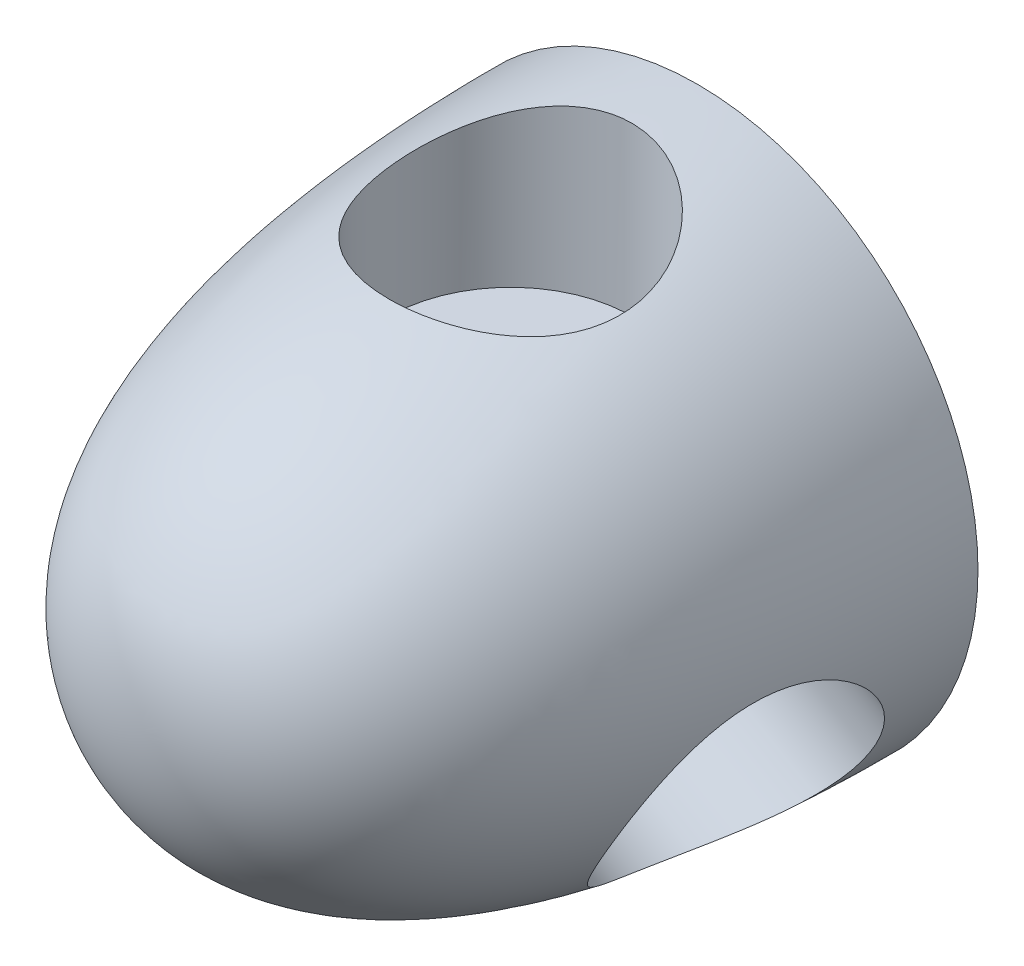
ISO-10303-21;
HEADER;
FILE_DESCRIPTION(('STEP AP214'),'2;1');
FILE_NAME('part.step','',(''),(''),'','','');
FILE_SCHEMA(('AUTOMOTIVE_DESIGN { 1 0 10303 214 1 1 1 1 }'));
ENDSEC;
DATA;
#1=APPLICATION_CONTEXT('core data for automotive mechanical design processes');
#2=APPLICATION_PROTOCOL_DEFINITION('international standard','automotive_design',2000,#1);
#3=PRODUCT_CONTEXT('',#1,'mechanical');
#4=PRODUCT('Part','Part','',(#3));
#5=PRODUCT_RELATED_PRODUCT_CATEGORY('part','',(#4));
#6=PRODUCT_DEFINITION_FORMATION('','',#4);
#7=PRODUCT_DEFINITION_CONTEXT('part definition',#1,'design');
#8=PRODUCT_DEFINITION('design','',#6,#7);
#9=PRODUCT_DEFINITION_SHAPE('','',#8);
#10=(LENGTH_UNIT() NAMED_UNIT(*) SI_UNIT(.MILLI.,.METRE.));
#11=(NAMED_UNIT(*) PLANE_ANGLE_UNIT() SI_UNIT($,.RADIAN.));
#12=(NAMED_UNIT(*) SI_UNIT($,.STERADIAN.) SOLID_ANGLE_UNIT());
#13=UNCERTAINTY_MEASURE_WITH_UNIT(LENGTH_MEASURE(1.E-05),#10,'distance_accuracy_value','');
#14=(GEOMETRIC_REPRESENTATION_CONTEXT(3) GLOBAL_UNCERTAINTY_ASSIGNED_CONTEXT((#13)) GLOBAL_UNIT_ASSIGNED_CONTEXT((#10,
#11,#12)) REPRESENTATION_CONTEXT('',''));
#15=CARTESIAN_POINT('',(0.,0.,0.));
#16=DIRECTION('',(0.,0.,1.));
#17=DIRECTION('',(1.,0.,0.));
#18=AXIS2_PLACEMENT_3D('',#15,#16,#17);
#19=CARTESIAN_POINT('',(0.,19.05,-38.1));
#20=CARTESIAN_POINT('',(0.,19.05,-23.9009683428763));
#21=CARTESIAN_POINT('',(0.,16.9337441759972,0.));
#22=CARTESIAN_POINT('',(0.,0.,0.));
#23=B_SPLINE_CURVE_WITH_KNOTS('',3,(#19,#20,#21,#22),.UNSPECIFIED.,.F.,.F.,(4,4),(0.,1.),.UNSPECIFIED.);
#24=CARTESIAN_POINT('',(0.,0.,26.4035099652344));
#25=DIRECTION('',(0.,0.,1.));
#26=AXIS1_PLACEMENT('',#24,#25);
#27=SURFACE_OF_REVOLUTION('',#23,#26);
#28=CARTESIAN_POINT('',(-18.338251247711,-1.05554135001232,-25.4));
#29=CARTESIAN_POINT('',(-18.3132255403974,-1.04109096691939,-25.1821406028059));
#30=CARTESIAN_POINT('',(-18.2867299690812,-1.03576026781716,-24.9638653361562));
#31=CARTESIAN_POINT('',(-18.2309375606609,-1.04355308694575,-24.5280100617168));
#32=CARTESIAN_POINT('',(-18.2016410185457,-1.05667466383545,-24.3104299832009));
#33=CARTESIAN_POINT('',(-18.140302448093,-1.10133095664503,-23.8776443267072));
#34=CARTESIAN_POINT('',(-18.108261445462,-1.13285881885448,-23.6624378952598));
#35=CARTESIAN_POINT('',(-18.0413656867623,-1.21402161156929,-23.2359047372756));
#36=CARTESIAN_POINT('',(-18.0065108273885,-1.26365720709886,-23.0245781535295));
#37=CARTESIAN_POINT('',(-17.9338631580454,-1.38043747094698,-22.60751792359));
#38=CARTESIAN_POINT('',(-17.8960725691054,-1.44756899153432,-22.4017802051635));
#39=CARTESIAN_POINT('',(-17.8172953477507,-1.59858583342111,-21.997188378116));
#40=CARTESIAN_POINT('',(-17.7763087318569,-1.68247106812015,-21.7983342339199));
#41=CARTESIAN_POINT('',(-17.6908332787788,-1.86605842307884,-21.4088284086526));
#42=CARTESIAN_POINT('',(-17.6463440396681,-1.96576235987224,-21.2181776728165));
#43=CARTESIAN_POINT('',(-17.5535051396194,-2.17993959255016,-20.8462600472301));
#44=CARTESIAN_POINT('',(-17.505154087247,-2.29441822107739,-20.6649965788978));
#45=CARTESIAN_POINT('',(-17.403279734969,-2.53924794898595,-20.3096994053259));
#46=CARTESIAN_POINT('',(-17.3496757808335,-2.66985873291386,-20.135867809447));
#47=CARTESIAN_POINT('',(-17.2377009813602,-2.94387505254788,-19.8002389983359));
#48=CARTESIAN_POINT('',(-17.1793299862201,-3.08728099034971,-19.6384421615966));
#49=CARTESIAN_POINT('',(-17.0574399520563,-3.38558754302899,-19.3278153421201));
#50=CARTESIAN_POINT('',(-16.9939194159118,-3.54049149960127,-19.1789891566111));
#51=CARTESIAN_POINT('',(-16.8614504652655,-3.86033404969433,-18.8952990762229));
#52=CARTESIAN_POINT('',(-16.7925037375717,-4.02526952118368,-18.7604308722542));
#53=CARTESIAN_POINT('',(-16.6458383559802,-4.37108792275384,-18.4999633434661));
#54=CARTESIAN_POINT('',(-16.5678704238896,-4.55235135704167,-18.375008794062));
#55=CARTESIAN_POINT('',(-16.4055666022298,-4.92272348937912,-18.1419909713554));
#56=CARTESIAN_POINT('',(-16.3212305303333,-5.11183241198443,-18.0339281819561));
#57=CARTESIAN_POINT('',(-16.1461482898674,-5.49625501558963,-17.8354830396041));
#58=CARTESIAN_POINT('',(-16.0554023056279,-5.69156851807561,-17.7451001785111));
#59=CARTESIAN_POINT('',(-15.8676020458417,-6.08674673287268,-17.582702741381));
#60=CARTESIAN_POINT('',(-15.7705478732272,-6.28661137088732,-17.5106878657237));
#61=CARTESIAN_POINT('',(-15.5708766704435,-6.68825702474376,-17.3859022822127));
#62=CARTESIAN_POINT('',(-15.4682886242767,-6.89002420982705,-17.3330407297363));
#63=CARTESIAN_POINT('',(-15.2575553109791,-7.2947733807142,-17.2465162404061));
#64=CARTESIAN_POINT('',(-15.1494100440715,-7.49775536646929,-17.2128533027816));
#65=CARTESIAN_POINT('',(-14.9281759847379,-7.90328784749894,-17.1650163720421));
#66=CARTESIAN_POINT('',(-14.8150878459817,-8.10583839613573,-17.1508398099502));
#67=CARTESIAN_POINT('',(-14.5847176838103,-8.50896590268909,-17.1420907476886));
#68=CARTESIAN_POINT('',(-14.4674357335467,-8.70954289495214,-17.1475179057413));
#69=CARTESIAN_POINT('',(-14.2324029649059,-9.10253618175611,-17.1775678914416));
#70=CARTESIAN_POINT('',(-14.1147286561624,-9.29503332856662,-17.2017342803041));
#71=CARTESIAN_POINT('',(-13.8772282572263,-9.67544122002487,-17.2685097482364));
#72=CARTESIAN_POINT('',(-13.7574022037144,-9.86335204272691,-17.3111185132053));
#73=CARTESIAN_POINT('',(-13.5166730001384,-10.2334217278372,-17.414438765366));
#74=CARTESIAN_POINT('',(-13.3957698223591,-10.4155804416882,-17.4751507196792));
#75=CARTESIAN_POINT('',(-13.1540535202759,-10.7730987414592,-17.6142081780558));
#76=CARTESIAN_POINT('',(-13.0332403971189,-10.9484582422,-17.6925539029479));
#77=CARTESIAN_POINT('',(-12.7922808190888,-11.2924059180293,-17.8667764610262));
#78=CARTESIAN_POINT('',(-12.6721416646983,-11.4609516368785,-17.9627471715727));
#79=CARTESIAN_POINT('',(-12.434473006335,-11.7895097640714,-18.1712853298208));
#80=CARTESIAN_POINT('',(-12.3169444914932,-11.9495189691954,-18.2838589487326));
#81=CARTESIAN_POINT('',(-12.0859256940513,-12.2602297898822,-18.5247869658668));
#82=CARTESIAN_POINT('',(-11.9724345591941,-12.4109333747851,-18.6531380078129));
#83=CARTESIAN_POINT('',(-11.7508047280878,-12.7025699444456,-18.9248667835384));
#84=CARTESIAN_POINT('',(-11.642668542657,-12.8434983580193,-19.0682514698604));
#85=CARTESIAN_POINT('',(-11.4306244806416,-13.118395812347,-19.3728234252303));
#86=CARTESIAN_POINT('',(-11.3268876752748,-13.2521060187795,-19.5343636775904));
#87=CARTESIAN_POINT('',(-11.1281621066984,-13.5081849435874,-19.8710873932665));
#88=CARTESIAN_POINT('',(-11.0331693722447,-13.630558810685,-20.0462645957797));
#89=CARTESIAN_POINT('',(-10.853363414889,-13.8637013955616,-20.4092423262025));
#90=CARTESIAN_POINT('',(-10.7685542119203,-13.9744655282371,-20.5970477937628));
#91=CARTESIAN_POINT('',(-10.6106708848611,-14.1839517587486,-20.9838589055913));
#92=CARTESIAN_POINT('',(-10.5375917328054,-14.2826790116823,-21.1828597014331));
#93=CARTESIAN_POINT('',(-10.4051895266833,-14.4668986141064,-21.5886313892175));
#94=CARTESIAN_POINT('',(-10.3457335977602,-14.5525158397158,-21.795302162164));
#95=CARTESIAN_POINT('',(-10.2408295161392,-14.7114510690772,-22.2167763423075));
#96=CARTESIAN_POINT('',(-10.1953812798268,-14.7847691462439,-22.4315797009509));
#97=CARTESIAN_POINT('',(-10.1194966063699,-14.9188555519086,-22.8675691249547));
#98=CARTESIAN_POINT('',(-10.0890543540897,-14.9796287365023,-23.0887526826247));
#99=CARTESIAN_POINT('',(-10.0438747013651,-15.0884792395382,-23.5357952769567));
#100=CARTESIAN_POINT('',(-10.0291366454713,-15.1365570877855,-23.7616541180842));
#101=CARTESIAN_POINT('',(-10.0160789900574,-15.2178990956982,-24.2053235454945));
#102=CARTESIAN_POINT('',(-10.0170085127918,-15.2517613290419,-24.4230030128992));
#103=CARTESIAN_POINT('',(-10.0335142173786,-15.3077990019089,-24.8593005858151));
#104=CARTESIAN_POINT('',(-10.0490898878476,-15.3299748494305,-25.0779186582888));
#105=CARTESIAN_POINT('',(-10.0946599597297,-15.3626239120516,-25.5145262841532));
#106=CARTESIAN_POINT('',(-10.1246549219723,-15.3730966719142,-25.7325158127653));
#107=CARTESIAN_POINT('',(-10.198579043572,-15.3823595772055,-26.1663656902783));
#108=CARTESIAN_POINT('',(-10.2425084691572,-15.3811494994124,-26.3822259984177));
#109=CARTESIAN_POINT('',(-10.3436272635097,-15.367091375947,-26.8105416520689));
#110=CARTESIAN_POINT('',(-10.4008235087006,-15.3542372849071,-27.0229951705179));
#111=CARTESIAN_POINT('',(-10.5276184628152,-15.3169400725797,-27.443202719806));
#112=CARTESIAN_POINT('',(-10.5972215840199,-15.2924928232427,-27.6509550490331));
#113=CARTESIAN_POINT('',(-10.7478255590731,-15.2320768322234,-28.0605389746509));
#114=CARTESIAN_POINT('',(-10.8288253939105,-15.1961091202503,-28.2623710984354));
#115=CARTESIAN_POINT('',(-11.0011987965259,-15.1126978599323,-28.6591929761292));
#116=CARTESIAN_POINT('',(-11.0925761081734,-15.0652501629441,-28.8541802271985));
#117=CARTESIAN_POINT('',(-11.2916238394784,-14.9550347119322,-29.250333133288));
#118=CARTESIAN_POINT('',(-11.399997505221,-14.891399155422,-29.4509046266284));
#119=CARTESIAN_POINT('',(-11.6260240963162,-14.7510141064939,-29.8419802794998));
#120=CARTESIAN_POINT('',(-11.7436774783267,-14.674263968486,-30.0324839428181));
#121=CARTESIAN_POINT('',(-11.9869387745243,-14.5076406592613,-30.4025279167878));
#122=CARTESIAN_POINT('',(-12.1125512073891,-14.4177599948128,-30.5820618838056));
#123=CARTESIAN_POINT('',(-12.3702236867393,-14.2249894909913,-30.9290061262909));
#124=CARTESIAN_POINT('',(-12.5022816125515,-14.1221039129714,-31.0964203449339));
#125=CARTESIAN_POINT('',(-12.7789044997521,-13.8973402633902,-31.4270869545246));
#126=CARTESIAN_POINT('',(-12.9237575687022,-13.7747276909319,-31.5896006452737));
#127=CARTESIAN_POINT('',(-13.2173734400895,-13.5153008467625,-31.8988567869055));
#128=CARTESIAN_POINT('',(-13.366134672818,-13.378492213671,-32.0456054528126));
#129=CARTESIAN_POINT('',(-13.6659108434467,-13.0909228638953,-32.3222013702942));
#130=CARTESIAN_POINT('',(-13.8169258765712,-12.9401615562944,-32.4520479054773));
#131=CARTESIAN_POINT('',(-14.119431467998,-12.6251768527726,-32.6936007704942));
#132=CARTESIAN_POINT('',(-14.2709219942882,-12.4609543451794,-32.8053082959043));
#133=CARTESIAN_POINT('',(-14.5662212964586,-12.12695222889,-33.0050916253901));
#134=CARTESIAN_POINT('',(-14.710084813079,-11.9576982455964,-33.0939647748456));
#135=CARTESIAN_POINT('',(-14.9950022542441,-11.6083602329288,-33.2529981143827));
#136=CARTESIAN_POINT('',(-15.1360562318833,-11.4282764084749,-33.3231586584041));
#137=CARTESIAN_POINT('',(-15.413690746163,-11.0585242439642,-33.4438778740174));
#138=CARTESIAN_POINT('',(-15.5502739483341,-10.8688617928977,-33.4944484277262));
#139=CARTESIAN_POINT('',(-15.8175417927325,-10.4812537629843,-33.5753823133225));
#140=CARTESIAN_POINT('',(-15.9482269358228,-10.2833088902417,-33.6057473640819));
#141=CARTESIAN_POINT('',(-16.1910107703723,-9.89869123621395,-33.644075097458));
#142=CARTESIAN_POINT('',(-16.303728790355,-9.71258166512639,-33.6537900081367));
#143=CARTESIAN_POINT('',(-16.5222094375326,-9.33623334214296,-33.6559973760945));
#144=CARTESIAN_POINT('',(-16.6279725333561,-9.14599486960714,-33.6484909949843));
#145=CARTESIAN_POINT('',(-16.8317725119916,-8.7628853281786,-33.6163473351253));
#146=CARTESIAN_POINT('',(-16.9298104635329,-8.57001462778604,-33.591712430658));
#147=CARTESIAN_POINT('',(-17.1175968230774,-8.1831318130283,-33.525597618459));
#148=CARTESIAN_POINT('',(-17.2073451985096,-7.9891196941815,-33.4841176445441));
#149=CARTESIAN_POINT('',(-17.3755949248991,-7.60729269093802,-33.3862616411581));
#150=CARTESIAN_POINT('',(-17.4543527467473,-7.41946634620873,-33.3303693323782));
#151=CARTESIAN_POINT('',(-17.6035303216947,-7.0454578316082,-33.2036892311547));
#152=CARTESIAN_POINT('',(-17.67394714268,-6.85927626108319,-33.1328962248072));
#153=CARTESIAN_POINT('',(-17.8063525990815,-6.48995937656537,-32.9770826513727));
#154=CARTESIAN_POINT('',(-17.8683431351993,-6.30682338379442,-32.8920653025291));
#155=CARTESIAN_POINT('',(-17.9840284892817,-5.94470203932761,-32.7084569959109));
#156=CARTESIAN_POINT('',(-18.0377200848956,-5.76571832270756,-32.6098607936357));
#157=CARTESIAN_POINT('',(-18.1397997827937,-5.40310154398693,-32.3938886413729));
#158=CARTESIAN_POINT('',(-18.1877143065342,-5.2197806312428,-32.2757646836768));
#159=CARTESIAN_POINT('',(-18.2748412503756,-4.86029741724425,-32.0260236793815));
#160=CARTESIAN_POINT('',(-18.3140498179325,-4.68413831327618,-31.8944006967319));
#161=CARTESIAN_POINT('',(-18.3841755593521,-4.34021360387896,-31.6185560691322));
#162=CARTESIAN_POINT('',(-18.4150919297089,-4.17244881313099,-31.4743332050596));
#163=CARTESIAN_POINT('',(-18.4691211824069,-3.84643391614052,-31.1741449563633));
#164=CARTESIAN_POINT('',(-18.4922336132875,-3.68818436079269,-31.0181788930299));
#165=CARTESIAN_POINT('',(-18.532866580796,-3.36904630118806,-30.6813797885465));
#166=CARTESIAN_POINT('',(-18.5497313914245,-3.20911125485965,-30.4995625324565));
#167=CARTESIAN_POINT('',(-18.5755755133269,-2.90312546986241,-30.1241712961085));
#168=CARTESIAN_POINT('',(-18.5845572478294,-2.75707047683538,-29.9306009482839));
#169=CARTESIAN_POINT('',(-18.595365254265,-2.47996020666205,-29.532507812999));
#170=CARTESIAN_POINT('',(-18.59718407533,-2.34892068606812,-29.327973845143));
#171=CARTESIAN_POINT('',(-18.5943536894087,-2.10338741179392,-28.9093488384581));
#172=CARTESIAN_POINT('',(-18.5897068764267,-1.98888755136449,-28.6952613653721));
#173=CARTESIAN_POINT('',(-18.5738368770974,-1.76657458735284,-28.2357079931419));
#174=CARTESIAN_POINT('',(-18.5619741334192,-1.6607274319222,-27.9893083270157));
#175=CARTESIAN_POINT('',(-18.5320393331828,-1.47245653954558,-27.4880342341809));
#176=CARTESIAN_POINT('',(-18.513966567314,-1.39003548030094,-27.2331588423776));
#177=CARTESIAN_POINT('',(-18.4723882703837,-1.25024577240042,-26.7172932601795));
#178=CARTESIAN_POINT('',(-18.4488877417371,-1.19285419551789,-26.4563088978463));
#179=CARTESIAN_POINT('',(-18.3970688998614,-1.10431092680795,-25.9304216346254));
#180=CARTESIAN_POINT('',(-18.3687517353027,-1.07315298930375,-25.6655196817244));
#181=CARTESIAN_POINT('',(-18.338251247711,-1.05554135001232,-25.4));
#182=B_SPLINE_CURVE_WITH_KNOTS('',3,(#28,#29,#30,#31,#32,#33,#34,#35,#36,#37,#38,#39,#40,#41,
#42,#43,#44,#45,#46,#47,#48,#49,#50,#51,#52,#53,#54,#55,#56,#57,#58,#59,#60,#61,#62,#63,#64,#65,
#66,#67,#68,#69,#70,#71,#72,#73,#74,#75,#76,#77,#78,#79,#80,#81,#82,#83,#84,#85,#86,#87,#88,#89,
#90,#91,#92,#93,#94,#95,#96,#97,#98,#99,#100,#101,#102,#103,#104,#105,#106,#107,#108,#109,#110,
#111,#112,#113,#114,#115,#116,#117,#118,#119,#120,#121,#122,#123,#124,#125,#126,#127,#128,#129,
#130,#131,#132,#133,#134,#135,#136,#137,#138,#139,#140,#141,#142,#143,#144,#145,#146,#147,#148,
#149,#150,#151,#152,#153,#154,#155,#156,#157,#158,#159,#160,#161,#162,#163,#164,#165,#166,#167,
#168,#169,#170,#171,#172,#173,#174,#175,#176,#177,#178,#179,#180,#181),.UNSPECIFIED.,.T.,.F.,(4,
2,2,2,2,2,2,2,2,2,2,2,2,2,2,2,2,2,2,2,2,2,2,2,2,2,2,2,2,2,2,2,2,2,2,2,2,2,2,2,2,2,2,2,2,2,2,2,2,
2,2,2,2,2,2,2,2,2,2,2,2,2,2,2,2,2,2,2,2,2,2,2,2,2,2,2,4),(0.,0.659069173698017,1.31806901273081,
1.97682362488091,2.6356024328738,3.29388760610296,3.9521693767259,4.61052679563518,
5.26912250410829,5.94019921713904,6.61129702660875,7.28259064822643,7.95367640686057,
8.65351720425097,9.35337804651306,10.0532187710644,10.753048079022,11.4495132330367,
12.1459783590907,12.8423516581889,13.5387128165483,14.2186255937823,14.8985267915534,
15.5784455345134,16.2583727926089,16.9420325627508,17.6259470889153,18.3097163792775,
18.9938032959514,19.694834241764,20.3955452171106,21.0965318939878,21.7972172931072,
22.490746227949,23.1842710229108,23.8775268506704,24.5707537427264,25.2308559526864,
25.8909351154443,26.5510399536487,27.2111574043918,27.8716177731066,28.5323134929311,
29.1929501756587,29.8538259571559,30.5631260448625,31.2724610592674,31.9822024645706,
32.6917119070597,33.4403502085802,34.188692283937,34.9370660672122,35.6853905037202,
36.4021872544648,37.1189704463887,37.8353181972033,38.5516050008866,39.2041869913654,
39.8567249651737,40.5091725050342,41.1616226083514,41.7945177102103,42.427634637678,
43.060608516288,43.6938275548052,44.3629644462726,45.0323968554661,45.7018941086009,
46.3714300857428,47.098817670626,47.8259815808482,48.5539016880701,49.2815523429456,
50.0856412990738,50.8898221290235,51.6932647347959,52.4965160036806),.UNSPECIFIED.);
#183=CARTESIAN_POINT('',(-18.338251247711,-1.05554135001232,-25.4));
#184=VERTEX_POINT('',#183);
#185=EDGE_CURVE('E56',#184,#184,#182,.T.);
#186=ORIENTED_EDGE('',*,*,#185,.T.);
#187=EDGE_LOOP('',(#186));
#188=FACE_BOUND('',#187,.T.);
#189=CARTESIAN_POINT('',(0.,0.,-38.1));
#190=DIRECTION('',(0.,0.,1.));
#191=DIRECTION('',(1.,0.,0.));
#192=AXIS2_PLACEMENT_3D('',#189,#190,#191);
#193=CIRCLE('',#192,19.05);
#194=CARTESIAN_POINT('',(19.05,0.,-38.1));
#195=VERTEX_POINT('',#194);
#196=EDGE_CURVE('E11',#195,#195,#193,.T.);
#197=ORIENTED_EDGE('',*,*,#196,.T.);
#198=EDGE_LOOP('',(#197));
#199=FACE_BOUND('',#198,.T.);
#200=CARTESIAN_POINT('',(0.,0.,0.));
#201=VERTEX_POINT('',#200);
#202=VERTEX_LOOP('',#201);
#203=FACE_BOUND('',#202,.T.);
#204=CARTESIAN_POINT('',(0.,18.9763018383334,-33.655));
#205=CARTESIAN_POINT('',(0.218211078954212,18.9763022513523,-33.6550005686562));
#206=CARTESIAN_POINT('',(0.43641442111094,18.9722345507482,-33.6463396951044));
#207=CARTESIAN_POINT('',(0.871144042653201,18.9560573129827,-33.6118008701064));
#208=CARTESIAN_POINT('',(1.08767040292133,18.9439481661432,-33.5859237543153));
#209=CARTESIAN_POINT('',(1.51743998162799,18.9119582977859,-33.5172507796383));
#210=CARTESIAN_POINT('',(1.73068310557535,18.8920773530295,-33.474454434761));
#211=CARTESIAN_POINT('',(2.15236542127592,18.8449772614248,-33.372415482399));
#212=CARTESIAN_POINT('',(2.36080452305338,18.8177579772558,-33.3131725671529));
#213=CARTESIAN_POINT('',(2.7708903116773,18.7566429551785,-33.1790487065769));
#214=CARTESIAN_POINT('',(2.97255493238313,18.7227667942276,-33.1042135777946));
#215=CARTESIAN_POINT('',(3.36856493301669,18.6489552318792,-32.9394834431129));
#216=CARTESIAN_POINT('',(3.56290753940635,18.6090175626559,-32.849582799352));
#217=CARTESIAN_POINT('',(3.94308256356838,18.5238613882089,-32.6555255845017));
#218=CARTESIAN_POINT('',(4.12891673854074,18.4786439802919,-32.5513719748853));
#219=CARTESIAN_POINT('',(4.49120576491486,18.3837451781798,-32.3295934773028));
#220=CARTESIAN_POINT('',(4.66765691282269,18.3340620418671,-32.21196332707));
#221=CARTESIAN_POINT('',(5.19895753091008,18.1743938736086,-31.8275222312541));
#222=CARTESIAN_POINT('',(5.53653946005925,18.0581933062236,-31.5389447915065));
#223=CARTESIAN_POINT('',(6.16002799663892,17.8182337172331,-30.9131112452231));
#224=CARTESIAN_POINT('',(6.44591148077657,17.6944713463876,-30.5758334770679));
#225=CARTESIAN_POINT('',(6.84188005031169,17.5048624089158,-30.024967637072));
#226=CARTESIAN_POINT('',(6.97232701290917,17.4385706693425,-29.825876894076));
#227=CARTESIAN_POINT('',(7.21574423415548,17.3076613694495,-29.4167965166386));
#228=CARTESIAN_POINT('',(7.32872054004017,17.2430432363096,-29.2068106871496));
#229=CARTESIAN_POINT('',(7.5364327117597,17.1167773433105,-28.7770127256739));
#230=CARTESIAN_POINT('',(7.63115937505361,17.0551310937352,-28.5571957047011));
#231=CARTESIAN_POINT('',(7.80144100117607,16.9361654206379,-28.1092295823325));
#232=CARTESIAN_POINT('',(7.87700461082378,16.8788440538589,-27.8810842921986));
#233=CARTESIAN_POINT('',(8.00789634162893,16.7699796676346,-27.4189182659425));
#234=CARTESIAN_POINT('',(8.06331745887122,16.7184108746828,-27.1849300029271));
#235=CARTESIAN_POINT('',(8.15368195587697,16.6218330055621,-26.7116858889895));
#236=CARTESIAN_POINT('',(8.18862522858259,16.5768239636885,-26.4724300105351));
#237=CARTESIAN_POINT('',(8.23739996769746,16.4943015195881,-25.9906383213747));
#238=CARTESIAN_POINT('',(8.25124438777342,16.4567835305268,-25.7481046154564));
#239=CARTESIAN_POINT('',(8.25742313991828,16.3898765340559,-25.2616487222552));
#240=CARTESIAN_POINT('',(8.2497593006894,16.360486835786,-25.0177266547752));
#241=CARTESIAN_POINT('',(8.21419554900191,16.3121849419798,-24.5499333079105));
#242=CARTESIAN_POINT('',(8.1879438602203,16.2926279706806,-24.3260018388071));
#243=CARTESIAN_POINT('',(8.11708934597051,16.2607395680525,-23.8805463791341));
#244=CARTESIAN_POINT('',(8.07248752975279,16.2484077394339,-23.6590222568489));
#245=CARTESIAN_POINT('',(7.96519068206704,16.2307519281812,-23.2201388566519));
#246=CARTESIAN_POINT('',(7.90249711257766,16.2254273794884,-23.0027792437227));
#247=CARTESIAN_POINT('',(7.75945953938698,16.2213314487669,-22.5738871624903));
#248=CARTESIAN_POINT('',(7.67911557113858,16.2225600535756,-22.3623546824836));
#249=CARTESIAN_POINT('',(7.50457508652718,16.2307647735812,-21.9541506548146));
#250=CARTESIAN_POINT('',(7.41097763621885,16.2375335018484,-21.7572181967883));
#251=CARTESIAN_POINT('',(7.20857080118281,16.2558279815828,-21.3714779053902));
#252=CARTESIAN_POINT('',(7.09975599507693,16.267355431275,-21.1826729990526));
#253=CARTESIAN_POINT('',(6.86772081906003,16.2943371027011,-20.8145040759658));
#254=CARTESIAN_POINT('',(6.74450417171299,16.3097903109181,-20.6351376368841));
#255=CARTESIAN_POINT('',(6.48439893158072,16.3437457334768,-20.2867946018461));
#256=CARTESIAN_POINT('',(6.34750410444134,16.3622493406748,-20.1178228008558));
#257=CARTESIAN_POINT('',(6.0552020567276,16.4021716796698,-19.7847896422554));
#258=CARTESIAN_POINT('',(5.89927264206554,16.4236775492973,-19.6211968413961));
#259=CARTESIAN_POINT('',(5.57469612528407,16.4679575197658,-19.3074872782167));
#260=CARTESIAN_POINT('',(5.40605414672928,16.4907311087182,-19.1573651396636));
#261=CARTESIAN_POINT('',(5.05697074579832,16.5365717949921,-18.8713698442033));
#262=CARTESIAN_POINT('',(4.87652284035333,16.55963904788,-18.7355046247445));
#263=CARTESIAN_POINT('',(4.5051133162269,16.6051017750843,-18.4790250841266));
#264=CARTESIAN_POINT('',(4.31415547360709,16.6274974862654,-18.3584053361852));
#265=CARTESIAN_POINT('',(3.9164581271744,16.6714619631989,-18.1294615584017));
#266=CARTESIAN_POINT('',(3.70940669789721,16.6929797023879,-18.0216689101614));
#267=CARTESIAN_POINT('',(3.28671169170763,16.7335167325747,-17.8239194505039));
#268=CARTESIAN_POINT('',(3.07106790985398,16.7525359639327,-17.7339630648161));
#269=CARTESIAN_POINT('',(2.63271795327242,16.7873321839229,-17.5725890675039));
#270=CARTESIAN_POINT('',(2.41001247748036,16.8031094922775,-17.5011696275603));
#271=CARTESIAN_POINT('',(1.95912240708195,16.8308187150126,-17.3774372059911));
#272=CARTESIAN_POINT('',(1.73093793619869,16.8427507161377,-17.3251237933572));
#273=CARTESIAN_POINT('',(1.27429743598264,16.862167114619,-17.2406939611263));
#274=CARTESIAN_POINT('',(1.04589910122419,16.8697168369112,-17.2082804558152));
#275=CARTESIAN_POINT('',(0.587087582102023,16.8803732168368,-17.1626765260383));
#276=CARTESIAN_POINT('',(0.356674413941267,16.8834799101674,-17.1494859471277));
#277=CARTESIAN_POINT('',(-0.104440347798179,16.8851367227885,-17.1424409376878));
#278=CARTESIAN_POINT('',(-0.335141910254467,16.8836872973746,-17.1485845750784));
#279=CARTESIAN_POINT('',(-0.79514739990477,16.8762856898303,-17.1801511724314));
#280=CARTESIAN_POINT('',(-1.02445134068592,16.8703335515439,-17.2055739446671));
#281=CARTESIAN_POINT('',(-1.47566642527759,16.8542978216727,-17.2748203605647));
#282=CARTESIAN_POINT('',(-1.69763536511261,16.844294502676,-17.3182868711237));
#283=CARTESIAN_POINT('',(-2.13706508685162,16.8205177309705,-17.4232209068863));
#284=CARTESIAN_POINT('',(-2.35452593461617,16.8067443333823,-17.4846881689108));
#285=CARTESIAN_POINT('',(-2.78348371165801,16.7759166603932,-17.6251570557117));
#286=CARTESIAN_POINT('',(-2.99498019563222,16.7588621407614,-17.7041599858262));
#287=CARTESIAN_POINT('',(-3.41060085409939,16.7220882441522,-17.8791179159225));
#288=CARTESIAN_POINT('',(-3.61472489898093,16.7023688203534,-17.9750732137614));
#289=CARTESIAN_POINT('',(-4.0171368100468,16.6606963729058,-18.1847492884799));
#290=CARTESIAN_POINT('',(-4.21529999495601,16.6387155152994,-18.2987038233564));
#291=CARTESIAN_POINT('',(-4.60147289753045,16.59361052211,-18.5426208895755));
#292=CARTESIAN_POINT('',(-4.7894790688391,16.5704859925392,-18.6725889607997));
#293=CARTESIAN_POINT('',(-5.15406499324501,16.5240435684958,-18.9476526390837));
#294=CARTESIAN_POINT('',(-5.33064431004403,16.5007256666783,-19.092748823211));
#295=CARTESIAN_POINT('',(-5.67122668747625,16.4549068223632,-19.3971360451616));
#296=CARTESIAN_POINT('',(-5.83522975621658,16.432405879339,-19.5564270738342));
#297=CARTESIAN_POINT('',(-6.15289390050983,16.3888182793481,-19.8917002050576));
#298=CARTESIAN_POINT('',(-6.30626402781221,16.3677714426269,-20.0679634074595));
#299=CARTESIAN_POINT('',(-6.59761037834033,16.3287725442074,-20.4330014280904));
#300=CARTESIAN_POINT('',(-6.735592294141,16.3108193367313,-20.621771578142));
#301=CARTESIAN_POINT('',(-6.99519281227402,16.2791161063752,-21.0105874842184));
#302=CARTESIAN_POINT('',(-7.11681152305516,16.2653660556375,-21.210633165501));
#303=CARTESIAN_POINT('',(-7.34272545937974,16.2431229530751,-21.6205595050431));
#304=CARTESIAN_POINT('',(-7.44702129022266,16.2346297175373,-21.8304398193303));
#305=CARTESIAN_POINT('',(-7.63508923142589,16.2239679681711,-22.253156704251));
#306=CARTESIAN_POINT('',(-7.71930467263199,16.2216484058297,-22.4657921879797));
#307=CARTESIAN_POINT('',(-7.86979620661556,16.2236063462348,-22.8972938181457));
#308=CARTESIAN_POINT('',(-7.93607260169483,16.2278837378038,-23.1161598595194));
#309=CARTESIAN_POINT('',(-8.05017966703607,16.2435366764108,-23.5583294563208));
#310=CARTESIAN_POINT('',(-8.09801604553765,16.2549100239853,-23.7816316159722));
#311=CARTESIAN_POINT('',(-8.17497883016267,16.2850160434492,-24.2309434477031));
#312=CARTESIAN_POINT('',(-8.20410577791869,16.3037485022691,-24.4569530412103));
#313=CARTESIAN_POINT('',(-8.24270071391806,16.3475851515702,-24.8998712277871));
#314=CARTESIAN_POINT('',(-8.2529795627808,16.3723716608102,-25.1167412823473));
#315=CARTESIAN_POINT('',(-8.25648073821801,16.4284546173351,-25.5497650105119));
#316=CARTESIAN_POINT('',(-8.24970363768083,16.4597508459342,-25.7659187079337));
#317=CARTESIAN_POINT('',(-8.21935372231391,16.5284485636729,-26.1960837338593));
#318=CARTESIAN_POINT('',(-8.19577888788663,16.5658507865216,-26.4100948016162));
#319=CARTESIAN_POINT('',(-8.13221908669889,16.64618370406,-26.8346101176461));
#320=CARTESIAN_POINT('',(-8.09223359420444,16.6891145758361,-27.0451142533458));
#321=CARTESIAN_POINT('',(-7.99522707089802,16.7808431982724,-27.4661838429961));
#322=CARTESIAN_POINT('',(-7.9378352934215,16.8297531976165,-27.6766392988992));
#323=CARTESIAN_POINT('',(-7.80693084860391,16.9317810949619,-28.0915031248124));
#324=CARTESIAN_POINT('',(-7.73341237898861,16.9849005030747,-28.2959092882096));
#325=CARTESIAN_POINT('',(-7.57087588740716,17.0944027509829,-28.6975437598927));
#326=CARTESIAN_POINT('',(-7.4818583620156,17.1507854861857,-28.8947722978979));
#327=CARTESIAN_POINT('',(-7.2889075800521,17.2658656374413,-29.2811733020733));
#328=CARTESIAN_POINT('',(-7.18496896691824,17.3245638792324,-29.4703428433606));
#329=CARTESIAN_POINT('',(-6.95396330630475,17.4479936576519,-29.8543851920403));
#330=CARTESIAN_POINT('',(-6.82571370390462,17.5128334711299,-30.0485129878815));
#331=CARTESIAN_POINT('',(-6.55334562244745,17.6427729116306,-30.4252076790716));
#332=CARTESIAN_POINT('',(-6.40922663131864,17.7078725469718,-30.6077742010629));
#333=CARTESIAN_POINT('',(-6.10582430961553,17.8371045845802,-30.9604011299154));
#334=CARTESIAN_POINT('',(-5.94653276845531,17.901236441142,-31.1304546761752));
#335=CARTESIAN_POINT('',(-5.61374252666627,18.0272158570368,-31.4568323360369));
#336=CARTESIAN_POINT('',(-5.44024906870077,18.0890642471906,-31.6131614722565));
#337=CARTESIAN_POINT('',(-5.07393298898803,18.2112529900304,-31.9160229132577));
#338=CARTESIAN_POINT('',(-4.88066073077986,18.2714757204343,-32.0620598666366));
#339=CARTESIAN_POINT('',(-4.48106421555743,18.3868246839636,-32.3371388613645));
#340=CARTESIAN_POINT('',(-4.27474566350071,18.4419531191463,-32.4661882560845));
#341=CARTESIAN_POINT('',(-3.85031993357053,18.5458517237852,-32.7061257206861));
#342=CARTESIAN_POINT('',(-3.6322149587247,18.5946230756837,-32.8170171690028));
#343=CARTESIAN_POINT('',(-3.1857161647097,18.6846193848879,-33.019468963029));
#344=CARTESIAN_POINT('',(-2.9573232701831,18.7258450186968,-33.1110310418057));
#345=CARTESIAN_POINT('',(-2.50776028463828,18.7971889429844,-33.2682256347529));
#346=CARTESIAN_POINT('',(-2.28714570360969,18.8278697151789,-33.3351926113147));
#347=CARTESIAN_POINT('',(-1.84015036763377,18.8810226669957,-33.4505988029771));
#348=CARTESIAN_POINT('',(-1.61376987587903,18.9034952205771,-33.4990388621522));
#349=CARTESIAN_POINT('',(-1.1571590008445,18.9396710663129,-33.5767730429876));
#350=CARTESIAN_POINT('',(-0.926930466844065,18.9533784531385,-33.6060761046842));
#351=CARTESIAN_POINT('',(-0.464464975361829,18.9716934199942,-33.6451888534918));
#352=CARTESIAN_POINT('',(-0.232228106338442,18.9763013987838,-33.6549993948156));
#353=CARTESIAN_POINT('',(0.,18.9763018383334,-33.655));
#354=B_SPLINE_CURVE_WITH_KNOTS('',3,(#204,#205,#206,#207,#208,#209,#210,#211,#212,#213,#214,
#215,#216,#217,#218,#219,#220,#221,#222,#223,#224,#225,#226,#227,#228,#229,#230,#231,#232,#233,
#234,#235,#236,#237,#238,#239,#240,#241,#242,#243,#244,#245,#246,#247,#248,#249,#250,#251,#252,
#253,#254,#255,#256,#257,#258,#259,#260,#261,#262,#263,#264,#265,#266,#267,#268,#269,#270,#271,
#272,#273,#274,#275,#276,#277,#278,#279,#280,#281,#282,#283,#284,#285,#286,#287,#288,#289,#290,
#291,#292,#293,#294,#295,#296,#297,#298,#299,#300,#301,#302,#303,#304,#305,#306,#307,#308,#309,
#310,#311,#312,#313,#314,#315,#316,#317,#318,#319,#320,#321,#322,#323,#324,#325,#326,#327,#328,
#329,#330,#331,#332,#333,#334,#335,#336,#337,#338,#339,#340,#341,#342,#343,#344,#345,#346,#347,
#348,#349,#350,#351,#352,#353),.UNSPECIFIED.,.T.,.F.,(4,2,2,2,2,2,2,2,2,2,2,2,2,2,2,2,2,2,2,2,2,
2,2,2,2,2,2,2,2,2,2,2,2,2,2,2,2,2,2,2,2,2,2,2,2,2,2,2,2,2,2,2,2,2,2,2,2,2,2,2,2,2,2,2,2,2,2,2,2,
2,2,2,2,2,4),(0.,0.65441143351927,1.30879110503476,1.96318957445094,2.61760029031835,
3.27011452431898,3.92287349165931,4.57549703447348,5.22837628533622,6.599422110165,
7.97107965748805,8.71157915998654,9.45182177191277,10.1924366861694,10.9327168206153,
11.6695343764557,12.4063557843322,13.1427246372924,13.8790308836721,14.5571090686166,
15.2351499644874,15.9131360838062,16.591120841323,17.2448277693707,17.8987681850216,
18.5525399434915,19.2066110546711,19.8869082783993,20.5669327718912,21.2473338780789,
21.9274921022916,22.6299027586448,23.3323301786492,24.0346882911209,24.7370305582888,
25.4286149867351,26.1201938586788,26.8117036229209,27.5032066538153,28.1816304430464,
28.860044313913,29.5385087021981,30.2169850124494,30.9051334400104,31.5935206044446,
32.2819340372734,32.9703470263216,33.6732742177604,34.3759405060636,35.0786021371458,
35.7812392105198,36.4665200148578,37.1517892703924,37.8368462252293,38.5218833469727,
39.1766884090502,39.8314714773249,40.4863332836886,41.141216070929,41.8111646792679,
42.4813547270867,43.1515233066214,43.8219330762414,44.5457179815262,45.2695262486739,
45.9937284524931,46.7176645110476,47.4655556842198,48.213122047118,48.9605491607189,
49.7079092316752,50.4047455253367,51.1015500677915,51.7980288578612,52.4944771257528),.UNSPECIFIED.);
#355=CARTESIAN_POINT('',(0.,18.9763018383334,-33.655));
#356=VERTEX_POINT('',#355);
#357=EDGE_CURVE('E48',#356,#356,#354,.T.);
#358=ORIENTED_EDGE('',*,*,#357,.T.);
#359=EDGE_LOOP('',(#358));
#360=FACE_BOUND('',#359,.T.);
#361=CARTESIAN_POINT('',(10.0832512477112,-15.3536207664932,-25.4));
#362=CARTESIAN_POINT('',(10.0582239952015,-15.3391730597584,-25.1821406028059));
#363=CARTESIAN_POINT('',(10.0403596887009,-15.3188925714619,-24.9638653361562));
#364=CARTESIAN_POINT('',(10.0192122638232,-15.2666785188673,-24.5280100617168));
#365=CARTESIAN_POINT('',(10.0159276116898,-15.2347461807076,-24.3104299832009));
#366=CARTESIAN_POINT('',(10.0239318104754,-15.159297274059,-23.8776443267072));
#367=CARTESIAN_POINT('',(10.0352152387603,-15.1157850207132,-23.6624378952598));
#368=CARTESIAN_POINT('',(10.0720563997435,-15.0172701979163,-23.2359047372756));
#369=CARTESIAN_POINT('',(10.0976146567172,-14.9622672064885,-23.0245781535295));
#370=CARTESIAN_POINT('',(10.1624254971988,-14.8409623473876,-22.60751792359));
#371=CARTESIAN_POINT('',(10.2016678049521,-14.7746689770479,-22.4017802051635));
#372=CARTESIAN_POINT('',(10.293063615748,-14.6309374811718,-21.997188378116));
#373=CARTESIAN_POINT('',(10.3452170520529,-14.5534994132431,-21.7983342339199));
#374=CARTESIAN_POINT('',(10.4614706387217,-14.3876818219981,-21.4088284086526));
#375=CARTESIAN_POINT('',(10.5255721612867,-14.2993010423366,-21.2181776728165));
#376=CARTESIAN_POINT('',(10.6646356356737,-14.111811580096,-20.8462600472301));
#377=CARTESIAN_POINT('',(10.7396015099825,-14.0126990261781,-20.6649965788978));
#378=CARTESIAN_POINT('',(10.9006930978139,-13.8020583851571,-20.3096994053259));
#379=CARTESIAN_POINT('',(10.9870033776359,-13.6903306071684,-20.135867809447));
#380=CARTESIAN_POINT('',(11.1683210717539,-13.4563494264239,-19.8002389983358));
#381=CARTESIAN_POINT('',(11.2633287593737,-13.3340956928874,-19.6384421615966));
#382=CARTESIAN_POINT('',(11.4607247950275,-13.0793825504939,-19.3278153421201));
#383=CARTESIAN_POINT('',(11.5631152884936,-12.9469201742446,-19.1789891566111));
#384=CARTESIAN_POINT('',(11.7738725867622,-12.6722774227257,-18.8952990762229));
#385=CARTESIAN_POINT('',(11.8822375312102,-12.5301000692903,-18.7604308722542));
#386=CARTESIAN_POINT('',(12.1083923612703,-12.2301749221912,-18.4999633434661));
#387=CARTESIAN_POINT('',(12.2263871340955,-12.0720209951763,-18.375008794062));
#388=CARTESIAN_POINT('',(12.4659868987237,-11.746275696319,-18.1419909713554));
#389=CARTESIAN_POINT('',(12.5875919938339,-11.5786840542985,-18.0339281819561));
#390=CARTESIAN_POINT('',(12.832970614112,-11.2348470845009,-17.8354830396041));
#391=CARTESIAN_POINT('',(12.9567440768472,-11.0586020056151,-17.7451001785111));
#392=CARTESIAN_POINT('',(13.2050783199906,-10.6983731024044,-17.582702741381));
#393=CARTESIAN_POINT('',(13.3296390875222,-10.5143894043697,-17.5106878657237));
#394=CARTESIAN_POINT('',(13.5776388256896,-10.1406462434266,-17.3859022822127));
#395=CARTESIAN_POINT('',(13.7010803105384,-9.95091879677984,-17.3330407297363));
#396=CARTESIAN_POINT('',(13.9462367180386,-9.56604380859691,-17.2465162404061));
#397=CARTESIAN_POINT('',(14.0679516407593,-9.37089626727833,-17.2128533027816));
#398=CARTESIAN_POINT('',(14.3085360417239,-8.97653571119825,-17.1650163720421));
#399=CARTESIAN_POINT('',(14.4274058930158,-8.7773232358503,-17.1508398099502));
#400=CARTESIAN_POINT('',(14.6613394735695,-8.37625306985926,-17.1420907476886));
#401=CARTESIAN_POINT('',(14.7764032691522,-8.17439542539403,-17.1475179057413));
#402=CARTESIAN_POINT('',(14.9992290547208,-7.77435443362739,-17.1775678914416));
#403=CARTESIAN_POINT('',(15.107099319643,-7.57619691947748,-17.2017342803041));
#404=CARTESIAN_POINT('',(15.3177920179778,-7.18031159486074,-17.2685097482364));
#405=CARTESIAN_POINT('',(15.4206145373279,-6.98258377713318,-17.3111185132053));
#406=CARTESIAN_POINT('',(15.6207396840159,-6.58907132884837,-17.4144387653661));
#407=CARTESIAN_POINT('',(15.7180421688419,-6.39328674856771,-17.4751507196792));
#408=CARTESIAN_POINT('',(15.9068039477198,-6.0051951405694,-17.6142081780558));
#409=CARTESIAN_POINT('',(15.9982631685777,-5.81288815643447,-17.6925539029479));
#410=CARTESIAN_POINT('',(16.1756508044035,-5.43223720266061,-17.8667764610262));
#411=CARTESIAN_POINT('',(16.2615461014308,-5.24392078354465,-17.9627471715728));
#412=CARTESIAN_POINT('',(16.4272514570181,-4.87381462412218,-18.1712853298209));
#413=CARTESIAN_POINT('',(16.5070592360739,-4.69202734203817,-18.2838589487326));
#414=CARTESIAN_POINT('',(16.6606333012984,-4.33660378435835,-18.5247869658668));
#415=CARTESIAN_POINT('',(16.734400866837,-4.16296578601619,-18.6531380078129));
#416=CARTESIAN_POINT('',(16.8761506292825,-3.82521043721146,-18.9248667835384));
#417=CARTESIAN_POINT('',(16.944130122837,-3.66109754677315,-19.0682514698604));
#418=CARTESIAN_POINT('',(17.0761762707127,-3.3400132751823,-19.3728234252303));
#419=CARTESIAN_POINT('',(17.1401043035451,-3.18331946321097,-19.5343636775904));
#420=CARTESIAN_POINT('',(17.2625123735144,-2.88317861003844,-19.8710873932665));
#421=CARTESIAN_POINT('',(17.3209948839534,-2.73972555527776,-20.0462645957797));
#422=CARTESIAN_POINT('',(17.4329993064826,-2.4674377360176,-20.4092423262025));
#423=CARTESIAN_POINT('',(17.4865192577235,-2.33860874543428,-20.5970477937627));
#424=CARTESIAN_POINT('',(17.5889979915598,-2.09713465811125,-20.9838589055913));
#425=CARTESIAN_POINT('',(17.6379587246184,-1.98448262947712,-21.1828597014331));
#426=CARTESIAN_POINT('',(17.7312964771317,-1.7777091542462,-21.5886313892175));
#427=CARTESIAN_POINT('',(17.7757152050494,-1.68341019658854,-21.795302162164));
#428=CARTESIAN_POINT('',(17.8609051104222,-1.51309298226335,-22.2167763423075));
#429=CARTESIAN_POINT('',(17.901676309649,-1.43707461647625,-22.4315797009509));
#430=CARTESIAN_POINT('',(17.9798562065283,-1.30431335867237,-22.8675691249548));
#431=CARTESIAN_POINT('',(18.0172662021152,-1.24756300255248,-23.0887526826247));
#432=CARTESIAN_POINT('',(18.0889436765968,-1.15401102404086,-23.5357952769567));
#433=CARTESIAN_POINT('',(18.1232112865913,-1.11720856911071,-23.7616541180842));
#434=CARTESIAN_POINT('',(18.1871267041316,-1.0652293038521,-24.2053235454945));
#435=CARTESIAN_POINT('',(18.2169170198033,-1.04910317748165,-24.4230030128992));
#436=CARTESIAN_POINT('',(18.2736999203685,-1.03537870052768,-24.8593005858151));
#437=CARTESIAN_POINT('',(18.3006926029071,-1.03777970307401,-25.0779186582888));
#438=CARTESIAN_POINT('',(18.3517525564879,-1.06092001166565,-25.5145262841532));
#439=CARTESIAN_POINT('',(18.3758197136978,-1.08166003102196,-25.7325158127653));
#440=CARTESIAN_POINT('',(18.4208036857929,-1.14104874563412,-26.1663656902783));
#441=CARTESIAN_POINT('',(18.441720440476,-1.17969778306118,-26.3822259984178));
#442=CARTESIAN_POINT('',(18.4801051456018,-1.27429828950312,-26.810541652069));
#443=CARTESIAN_POINT('',(18.4975712988141,-1.33025873635948,-27.0229951705179));
#444=CARTESIAN_POINT('',(18.5286684425055,-1.4587149938581,-27.443202719806));
#445=CARTESIAN_POINT('',(18.5422980641293,-1.5312166896726,-27.6509550490331));
#446=CARTESIAN_POINT('',(18.5652782686384,-1.69185155348919,-28.0605389746509));
#447=CARTESIAN_POINT('',(18.5746292337725,-1.77998332414725,-28.2623710984354));
#448=CARTESIAN_POINT('',(18.5885796646831,-1.97096869990801,-28.6591929761292));
#449=CARTESIAN_POINT('',(18.5931774095639,-2.07382762161832,-28.8541802271985));
#450=CARTESIAN_POINT('',(18.5972518947506,-2.30131573900006,-29.250333133288));
#451=CARTESIAN_POINT('',(18.5963287191,-2.42698786488951,-29.4509046266284));
#452=CARTESIAN_POINT('',(18.5877649959644,-2.69292515917281,-29.8419802794998));
#453=CARTESIAN_POINT('',(18.5801241177109,-2.83319104583903,-30.0324839428181));
#454=CARTESIAN_POINT('',(18.5574547471585,-3.12717316271599,-30.4025279167878));
#455=CARTESIAN_POINT('',(18.5424220248695,-3.28089705283235,-30.5820618838056));
#456=CARTESIAN_POINT('',(18.5043141111348,-3.60043321771651,-30.929006126291));
#457=CARTESIAN_POINT('',(18.4812415497927,-3.76624152525092,-31.0964203449339));
#458=CARTESIAN_POINT('',(18.4249019630083,-4.11818579762537,-31.4270869545246));
#459=CARTESIAN_POINT('',(18.3911428949111,-4.30493852138152,-31.5896006452737));
#460=CARTESIAN_POINT('',(18.3132805931304,-4.68893074704193,-31.8988567869055));
#461=CARTESIAN_POINT('',(18.2691814577805,-4.88616607022884,-32.0456054528126));
#462=CARTESIAN_POINT('',(18.1700271808392,-5.28956452433031,-32.3222013702942));
#463=CARTESIAN_POINT('',(18.1149715751114,-5.49572803316993,-32.4520479054773));
#464=CARTESIAN_POINT('',(17.9934396157714,-5.91519791189329,-32.6936007704942));
#465=CARTESIAN_POINT('',(17.9269640154676,-6.12850380988995,-32.8053082959043));
#466=CARTESIAN_POINT('',(17.7853593489284,-6.55124156543399,-33.0050916253901));
#467=CARTESIAN_POINT('',(17.7107128580146,-6.76045801715177,-33.0939647748456));
#468=CARTESIAN_POINT('',(17.5506359851195,-7.18187276551585,-33.2529981143827));
#469=CARTESIAN_POINT('',(17.4652058071513,-7.39407100568316,-33.3231586584041));
#470=CARTESIAN_POINT('',(17.2838082967206,-7.81938563027213,-33.4438778740174));
#471=CARTESIAN_POINT('',(17.1878473970386,-8.03250137861575,-33.4944484277262));
#472=CARTESIAN_POINT('',(16.9858029186219,-8.45776613643623,-33.5753823133225));
#473=CARTESIAN_POINT('',(16.8797202018231,-8.66991522662092,-33.6057473640819));
#474=CARTESIAN_POINT('',(16.6680234599659,-9.07248102198283,-33.644075097458));
#475=CARTESIAN_POINT('',(16.563206853508,-9.26315247629595,-33.6537900081367));
#476=CARTESIAN_POINT('',(16.3465199687214,-9.64053642847871,-33.6559973760945));
#477=CARTESIAN_POINT('',(16.23465016664,-9.82724919251262,-33.6484909949843));
#478=CARTESIAN_POINT('',(16.0047675606484,-10.195299922016,-33.6163473351253));
#479=CARTESIAN_POINT('',(15.8867556102334,-10.376638628782,-33.591712430658));
#480=CARTESIAN_POINT('',(15.6455984441379,-10.7327077940106,-33.525597618459));
#481=CARTESIAN_POINT('',(15.5224532082906,-10.9074382265067,-33.4841176445441));
#482=CARTESIAN_POINT('',(15.2759061868256,-11.2440602653615,-33.3862616411581));
#483=CARTESIAN_POINT('',(15.1526227117142,-11.4061797121934,-33.3303693323782));
#484=CARTESIAN_POINT('',(14.9033106243121,-11.7223755390731,-33.2036892311547));
#485=CARTESIAN_POINT('',(14.7772810650136,-11.8764490801626,-33.1328962248072));
#486=CARTESIAN_POINT('',(14.5236459891755,-12.1757740112649,-32.9770826513727));
#487=CARTESIAN_POINT('',(14.3960408351474,-12.3210273867226,-32.8920653025291));
#488=CARTESIAN_POINT('',(14.1402772286278,-12.6022745144371,-32.7084569959109));
#489=CARTESIAN_POINT('',(14.012118580978,-12.7382646585185,-32.6098607936357));
#490=CARTESIAN_POINT('',(13.7491230877165,-13.0079766594693,-32.3938886413729));
#491=CARTESIAN_POINT('',(13.6143197821054,-13.1411323106108,-32.2757646836768));
#492=CARTESIAN_POINT('',(13.3465616584693,-13.3963280643308,-32.0260236793815));
#493=CARTESIAN_POINT('',(13.2136076831035,-13.5183632318651,-31.8944006967319));
#494=CARTESIAN_POINT('',(12.9508230184861,-13.7510562600924,-31.6185560691322));
#495=CARTESIAN_POINT('',(12.8209926330162,-13.8617130175882,-31.4743332050596));
#496=CARTESIAN_POINT('',(12.5656700765593,-14.0715111714673,-31.1741449563633));
#497=CARTESIAN_POINT('',(12.4401781569308,-14.1706519014271,-31.0181788930299));
#498=CARTESIAN_POINT('',(12.1841129737529,-14.3654101133229,-30.6813797885465));
#499=CARTESIAN_POINT('',(12.0540375659914,-14.4599829909214,-30.4995625324565));
#500=CARTESIAN_POINT('',(11.801968163938,-14.635357549526,-30.1241712961085));
#501=CARTESIAN_POINT('',(11.6799716968783,-14.7161634562887,-29.9306009482839));
#502=CARTESIAN_POINT('',(11.4453911664764,-14.8640785995129,-29.532507812999));
#503=CARTESIAN_POINT('',(11.3328170232748,-14.9311735050571,-29.3279738451429));
#504=CARTESIAN_POINT('',(11.1187637773183,-15.0514889560838,-28.9093488384581));
#505=CARTESIAN_POINT('',(11.0172805829657,-15.1047146282095,-28.6952613653721));
#506=CARTESIAN_POINT('',(10.8168169088763,-15.2021272876381,-28.2357079931419));
#507=CARTESIAN_POINT('',(10.719219211516,-15.2447774279695,-27.9893083270157));
#508=CARTESIAN_POINT('',(10.5412044358065,-15.3129885766959,-27.4880342341809));
#509=CARTESIAN_POINT('',(10.4607893217594,-15.3385476319592,-27.2331588423776));
#510=CARTESIAN_POINT('',(10.3189387350648,-15.3724346245217,-26.7172932601795));
#511=CARTESIAN_POINT('',(10.257485907198,-15.3807783581526,-26.4563088978463));
#512=CARTESIAN_POINT('',(10.1548957662232,-15.3801735590486,-25.9304216346253));
#513=CARTESIAN_POINT('',(10.1137536185357,-15.3712291439297,-25.6655196817244));
#514=CARTESIAN_POINT('',(10.0832512477112,-15.3536207664932,-25.4));
#515=B_SPLINE_CURVE_WITH_KNOTS('',3,(#361,#362,#363,#364,#365,#366,#367,#368,#369,#370,#371,
#372,#373,#374,#375,#376,#377,#378,#379,#380,#381,#382,#383,#384,#385,#386,#387,#388,#389,#390,
#391,#392,#393,#394,#395,#396,#397,#398,#399,#400,#401,#402,#403,#404,#405,#406,#407,#408,#409,
#410,#411,#412,#413,#414,#415,#416,#417,#418,#419,#420,#421,#422,#423,#424,#425,#426,#427,#428,
#429,#430,#431,#432,#433,#434,#435,#436,#437,#438,#439,#440,#441,#442,#443,#444,#445,#446,#447,
#448,#449,#450,#451,#452,#453,#454,#455,#456,#457,#458,#459,#460,#461,#462,#463,#464,#465,#466,
#467,#468,#469,#470,#471,#472,#473,#474,#475,#476,#477,#478,#479,#480,#481,#482,#483,#484,#485,
#486,#487,#488,#489,#490,#491,#492,#493,#494,#495,#496,#497,#498,#499,#500,#501,#502,#503,#504,
#505,#506,#507,#508,#509,#510,#511,#512,#513,#514),.UNSPECIFIED.,.T.,.F.,(4,2,2,2,2,2,2,2,2,2,2,
2,2,2,2,2,2,2,2,2,2,2,2,2,2,2,2,2,2,2,2,2,2,2,2,2,2,2,2,2,2,2,2,2,2,2,2,2,2,2,2,2,2,2,2,2,2,2,2,
2,2,2,2,2,2,2,2,2,2,2,2,2,2,2,2,2,4),(0.,0.65906917369802,1.31806901273081,1.97682362488092,
2.63560243287381,3.29388760610297,3.95216937672592,4.61052679563519,5.26912250410829,
5.94019921713904,6.61129702660876,7.28259064822644,7.95367640686058,8.65351720425098,
9.35337804651307,10.0532187710644,10.753048079022,11.4495132330367,12.1459783590907,
12.8423516581889,13.5387128165483,14.2186255937824,14.8985267915534,15.5784455345135,
16.258372792609,16.9420325627508,17.6259470889153,18.3097163792775,18.9938032959514,
19.694834241764,20.3955452171106,21.0965318939878,21.7972172931073,22.490746227949,
23.1842710229108,23.8775268506704,24.5707537427264,25.2308559526864,25.8909351154443,
26.5510399536487,27.2111574043918,27.8716177731066,28.5323134929311,29.1929501756587,
29.8538259571559,30.5631260448625,31.2724610592675,31.9822024645707,32.6917119070598,
33.4403502085802,34.188692283937,34.9370660672123,35.6853905037202,36.4021872544648,
37.1189704463888,37.8353181972033,38.5516050008867,39.2041869913654,39.8567249651737,
40.5091725050342,41.1616226083514,41.7945177102103,42.427634637678,43.060608516288,
43.6938275548052,44.3629644462726,45.0323968554661,45.7018941086009,46.3714300857429,
47.098817670626,47.8259815808482,48.5539016880701,49.2815523429456,50.0856412990738,
50.8898221290235,51.6932647347959,52.4965160036806),.UNSPECIFIED.);
#516=CARTESIAN_POINT('',(10.0832512477112,-15.3536207664932,-25.4));
#517=VERTEX_POINT('',#516);
#518=EDGE_CURVE('E51',#517,#517,#515,.T.);
#519=ORIENTED_EDGE('',*,*,#518,.T.);
#520=EDGE_LOOP('',(#519));
#521=FACE_BOUND('',#520,.T.);
#522=ADVANCED_FACE('F32',(#188,#199,#203,#360,#521),#27,.T.);
#523=CARTESIAN_POINT('',(0.,0.,-38.1));
#524=DIRECTION('',(0.,0.,1.));
#525=DIRECTION('',(1.,0.,0.));
#526=AXIS2_PLACEMENT_3D('',#523,#524,#525);
#527=PLANE('',#526);
#528=CARTESIAN_POINT('',(0.,0.,-38.1));
#529=DIRECTION('',(0.,0.,-1.));
#530=DIRECTION('',(-1.,0.,0.));
#531=AXIS2_PLACEMENT_3D('',#528,#529,#530);
#532=CIRCLE('',#531,4.826);
#533=CARTESIAN_POINT('',(-4.826,0.,-38.1));
#534=VERTEX_POINT('',#533);
#535=EDGE_CURVE('E103',#534,#534,#532,.T.);
#536=ORIENTED_EDGE('',*,*,#535,.F.);
#537=EDGE_LOOP('',(#536));
#538=FACE_BOUND('',#537,.T.);
#539=ORIENTED_EDGE('',*,*,#196,.F.);
#540=EDGE_LOOP('',(#539));
#541=FACE_BOUND('',#540,.T.);
#542=ADVANCED_FACE('F34',(#538,#541),#527,.F.);
#543=CARTESIAN_POINT('',(0.,0.,-25.4));
#544=DIRECTION('',(0.,0.,-1.));
#545=DIRECTION('',(-1.,0.,0.));
#546=AXIS2_PLACEMENT_3D('',#543,#544,#545);
#547=CYLINDRICAL_SURFACE('',#546,4.826);
#548=CARTESIAN_POINT('',(0.,0.,-25.4));
#549=DIRECTION('',(0.,0.,-1.));
#550=DIRECTION('',(-1.,0.,0.));
#551=AXIS2_PLACEMENT_3D('',#548,#549,#550);
#552=CIRCLE('',#551,4.826);
#553=CARTESIAN_POINT('',(-4.826,0.,-25.4));
#554=VERTEX_POINT('',#553);
#555=EDGE_CURVE('E39',#554,#554,#552,.T.);
#556=ORIENTED_EDGE('',*,*,#555,.F.);
#557=EDGE_LOOP('',(#556));
#558=FACE_BOUND('',#557,.T.);
#559=ORIENTED_EDGE('',*,*,#535,.T.);
#560=EDGE_LOOP('',(#559));
#561=FACE_BOUND('',#560,.T.);
#562=ADVANCED_FACE('F121',(#558,#561),#547,.F.);
#563=CARTESIAN_POINT('',(0.,0.,-25.4));
#564=DIRECTION('',(0.,0.,-1.));
#565=DIRECTION('',(-1.,0.,0.));
#566=AXIS2_PLACEMENT_3D('',#563,#564,#565);
#567=PLANE('',#566);
#568=ORIENTED_EDGE('',*,*,#555,.T.);
#569=EDGE_LOOP('',(#568));
#570=FACE_BOUND('',#569,.T.);
#571=ADVANCED_FACE('F117',(#570),#567,.T.);
#572=CARTESIAN_POINT('',(0.,7.62,-25.4));
#573=DIRECTION('',(0.,1.,0.));
#574=DIRECTION('',(0.,0.,1.));
#575=AXIS2_PLACEMENT_3D('',#572,#573,#574);
#576=PLANE('',#575);
#577=CARTESIAN_POINT('',(0.,7.62,-25.4));
#578=DIRECTION('',(0.,1.,0.));
#579=DIRECTION('',(0.,0.,1.));
#580=AXIS2_PLACEMENT_3D('',#577,#578,#579);
#581=CIRCLE('',#580,8.255);
#582=CARTESIAN_POINT('',(0.,7.62,-17.145));
#583=VERTEX_POINT('',#582);
#584=EDGE_CURVE('E97',#583,#583,#581,.T.);
#585=ORIENTED_EDGE('',*,*,#584,.T.);
#586=EDGE_LOOP('',(#585));
#587=FACE_BOUND('',#586,.T.);
#588=ADVANCED_FACE('F120',(#587),#576,.T.);
#589=CARTESIAN_POINT('',(0.,19.051,-25.4));
#590=DIRECTION('',(0.,-1.,0.));
#591=DIRECTION('',(0.,0.,-1.));
#592=AXIS2_PLACEMENT_3D('',#589,#590,#591);
#593=CYLINDRICAL_SURFACE('',#592,8.255);
#594=ORIENTED_EDGE('',*,*,#357,.F.);
#595=EDGE_LOOP('',(#594));
#596=FACE_BOUND('',#595,.T.);
#597=ORIENTED_EDGE('',*,*,#584,.F.);
#598=EDGE_LOOP('',(#597));
#599=FACE_BOUND('',#598,.T.);
#600=ADVANCED_FACE('F77',(#596,#599),#593,.F.);
#601=CARTESIAN_POINT('',(-6.59911357683741,-3.81000000000003,-25.4));
#602=DIRECTION('',(-0.866025403784436,-0.500000000000004,0.));
#603=DIRECTION('',(0.,0.,1.));
#604=AXIS2_PLACEMENT_3D('',#601,#602,#603);
#605=PLANE('',#604);
#606=CARTESIAN_POINT('',(-6.59911357683741,-3.81000000000003,-25.4));
#607=DIRECTION('',(-0.866025403784436,-0.500000000000004,0.));
#608=DIRECTION('',(0.,0.,1.));
#609=AXIS2_PLACEMENT_3D('',#606,#607,#608);
#610=CIRCLE('',#609,8.255);
#611=CARTESIAN_POINT('',(-6.59911357683741,-3.81000000000003,-17.145));
#612=VERTEX_POINT('',#611);
#613=EDGE_CURVE('E92',#612,#612,#610,.T.);
#614=ORIENTED_EDGE('',*,*,#613,.T.);
#615=EDGE_LOOP('',(#614));
#616=FACE_BOUND('',#615,.T.);
#617=ADVANCED_FACE('F73',(#616),#605,.T.);
#618=CARTESIAN_POINT('',(-22.5375749837486,-13.0120749837488,-25.4));
#619=DIRECTION('',(0.866025403784436,0.500000000000004,0.));
#620=DIRECTION('',(-0.500000000000004,0.866025403784436,0.));
#621=AXIS2_PLACEMENT_3D('',#618,#619,#620);
#622=CYLINDRICAL_SURFACE('',#621,8.255);
#623=ORIENTED_EDGE('',*,*,#185,.F.);
#624=EDGE_LOOP('',(#623));
#625=FACE_BOUND('',#624,.T.);
#626=ORIENTED_EDGE('',*,*,#613,.F.);
#627=EDGE_LOOP('',(#626));
#628=FACE_BOUND('',#627,.T.);
#629=ADVANCED_FACE('F76',(#625,#628),#622,.F.);
#630=CARTESIAN_POINT('',(6.59911357683746,-3.80999999999994,-25.4));
#631=DIRECTION('',(0.866025403784443,-0.499999999999992,0.));
#632=DIRECTION('',(0.,0.,1.));
#633=AXIS2_PLACEMENT_3D('',#630,#631,#632);
#634=PLANE('',#633);
#635=CARTESIAN_POINT('',(6.59911357683746,-3.80999999999994,-25.4));
#636=DIRECTION('',(0.866025403784443,-0.499999999999992,0.));
#637=DIRECTION('',(0.,0.,1.));
#638=AXIS2_PLACEMENT_3D('',#635,#636,#637);
#639=CIRCLE('',#638,8.255);
#640=CARTESIAN_POINT('',(6.59911357683746,-3.80999999999994,-17.145));
#641=VERTEX_POINT('',#640);
#642=EDGE_CURVE('E53',#641,#641,#639,.T.);
#643=ORIENTED_EDGE('',*,*,#642,.T.);
#644=EDGE_LOOP('',(#643));
#645=FACE_BOUND('',#644,.T.);
#646=ADVANCED_FACE('F82',(#645),#634,.T.);
#647=CARTESIAN_POINT('',(22.5375749837487,-13.0120749837484,-25.4));
#648=DIRECTION('',(-0.866025403784443,0.499999999999992,0.));
#649=DIRECTION('',(-0.499999999999992,-0.866025403784443,0.));
#650=AXIS2_PLACEMENT_3D('',#647,#648,#649);
#651=CYLINDRICAL_SURFACE('',#650,8.255);
#652=ORIENTED_EDGE('',*,*,#518,.F.);
#653=EDGE_LOOP('',(#652));
#654=FACE_BOUND('',#653,.T.);
#655=ORIENTED_EDGE('',*,*,#642,.F.);
#656=EDGE_LOOP('',(#655));
#657=FACE_BOUND('',#656,.T.);
#658=ADVANCED_FACE('F68',(#654,#657),#651,.F.);
#659=CLOSED_SHELL('',(#522,#542,#562,#571,#588,#600,#617,#629,#646,#658));
#660=MANIFOLD_SOLID_BREP('B2',#659);
#661=ADVANCED_BREP_SHAPE_REPRESENTATION('',(#18,#660),#14);
#662=SHAPE_DEFINITION_REPRESENTATION(#9,#661);
ENDSEC;
END-ISO-10303-21;
